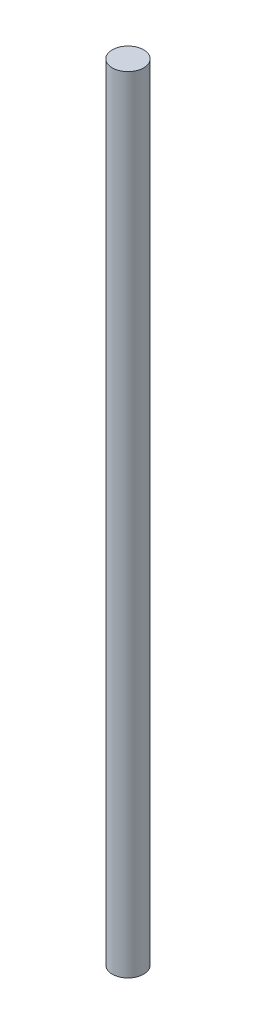
ISO-10303-21;
HEADER;
FILE_DESCRIPTION(('STEP AP214'),'2;1');
FILE_NAME('part.step','',(''),(''),'','','');
FILE_SCHEMA(('AUTOMOTIVE_DESIGN { 1 0 10303 214 1 1 1 1 }'));
ENDSEC;
DATA;
#1=APPLICATION_CONTEXT('core data for automotive mechanical design processes');
#2=APPLICATION_PROTOCOL_DEFINITION('international standard','automotive_design',2000,#1);
#3=PRODUCT_CONTEXT('',#1,'mechanical');
#4=PRODUCT('Part','Part','',(#3));
#5=PRODUCT_RELATED_PRODUCT_CATEGORY('part','',(#4));
#6=PRODUCT_DEFINITION_FORMATION('','',#4);
#7=PRODUCT_DEFINITION_CONTEXT('part definition',#1,'design');
#8=PRODUCT_DEFINITION('design','',#6,#7);
#9=PRODUCT_DEFINITION_SHAPE('','',#8);
#10=(LENGTH_UNIT() NAMED_UNIT(*) SI_UNIT(.MILLI.,.METRE.));
#11=(NAMED_UNIT(*) PLANE_ANGLE_UNIT() SI_UNIT($,.RADIAN.));
#12=(NAMED_UNIT(*) SI_UNIT($,.STERADIAN.) SOLID_ANGLE_UNIT());
#13=UNCERTAINTY_MEASURE_WITH_UNIT(LENGTH_MEASURE(1.E-05),#10,'distance_accuracy_value','');
#14=(GEOMETRIC_REPRESENTATION_CONTEXT(3) GLOBAL_UNCERTAINTY_ASSIGNED_CONTEXT((#13)) GLOBAL_UNIT_ASSIGNED_CONTEXT((#10,
#11,#12)) REPRESENTATION_CONTEXT('',''));
#15=CARTESIAN_POINT('',(0.,0.,0.));
#16=DIRECTION('',(0.,0.,1.));
#17=DIRECTION('',(1.,0.,0.));
#18=AXIS2_PLACEMENT_3D('',#15,#16,#17);
#19=CARTESIAN_POINT('',(0.,200.,0.));
#20=DIRECTION('',(0.,-1.,0.));
#21=DIRECTION('',(0.,0.,-1.));
#22=AXIS2_PLACEMENT_3D('',#19,#20,#21);
#23=CYLINDRICAL_SURFACE('',#22,4.);
#24=CARTESIAN_POINT('',(0.,200.,0.));
#25=DIRECTION('',(0.,1.,0.));
#26=DIRECTION('',(0.,0.,1.));
#27=AXIS2_PLACEMENT_3D('',#24,#25,#26);
#28=CIRCLE('',#27,4.);
#29=CARTESIAN_POINT('',(0.,200.,4.));
#30=VERTEX_POINT('',#29);
#31=EDGE_CURVE('E10',#30,#30,#28,.T.);
#32=ORIENTED_EDGE('',*,*,#31,.F.);
#33=EDGE_LOOP('',(#32));
#34=FACE_BOUND('',#33,.T.);
#35=CARTESIAN_POINT('',(0.,0.,0.));
#36=DIRECTION('',(0.,1.,0.));
#37=DIRECTION('',(0.,0.,1.));
#38=AXIS2_PLACEMENT_3D('',#35,#36,#37);
#39=CIRCLE('',#38,4.);
#40=CARTESIAN_POINT('',(0.,0.,4.));
#41=VERTEX_POINT('',#40);
#42=EDGE_CURVE('E44',#41,#41,#39,.T.);
#43=ORIENTED_EDGE('',*,*,#42,.T.);
#44=EDGE_LOOP('',(#43));
#45=FACE_BOUND('',#44,.T.);
#46=ADVANCED_FACE('F41',(#34,#45),#23,.T.);
#47=CARTESIAN_POINT('',(0.,200.,0.));
#48=DIRECTION('',(0.,1.,0.));
#49=DIRECTION('',(0.,0.,1.));
#50=AXIS2_PLACEMENT_3D('',#47,#48,#49);
#51=PLANE('',#50);
#52=ORIENTED_EDGE('',*,*,#31,.T.);
#53=EDGE_LOOP('',(#52));
#54=FACE_BOUND('',#53,.T.);
#55=ADVANCED_FACE('F58',(#54),#51,.T.);
#56=CARTESIAN_POINT('',(0.,0.,0.));
#57=DIRECTION('',(0.,1.,0.));
#58=DIRECTION('',(0.,0.,1.));
#59=AXIS2_PLACEMENT_3D('',#56,#57,#58);
#60=PLANE('',#59);
#61=ORIENTED_EDGE('',*,*,#42,.F.);
#62=EDGE_LOOP('',(#61));
#63=FACE_BOUND('',#62,.T.);
#64=ADVANCED_FACE('F56',(#63),#60,.F.);
#65=CLOSED_SHELL('',(#46,#55,#64));
#66=MANIFOLD_SOLID_BREP('B2',#65);
#67=ADVANCED_BREP_SHAPE_REPRESENTATION('',(#18,#66),#14);
#68=SHAPE_DEFINITION_REPRESENTATION(#9,#67);
ENDSEC;
END-ISO-10303-21;
